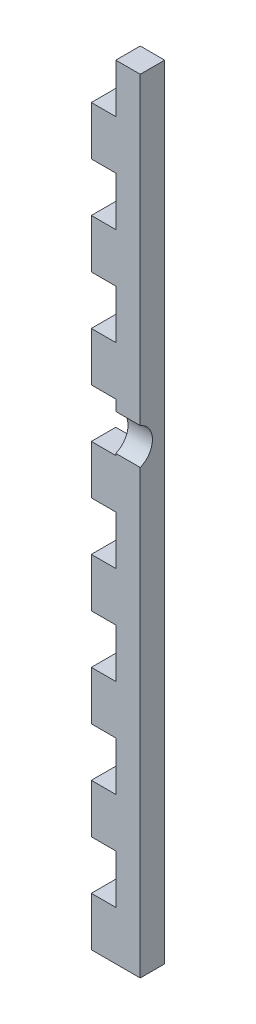
ISO-10303-21;
HEADER;
FILE_DESCRIPTION(('STEP AP214'),'2;1');
FILE_NAME('part.step','',(''),(''),'','','');
FILE_SCHEMA(('AUTOMOTIVE_DESIGN { 1 0 10303 214 1 1 1 1 }'));
ENDSEC;
DATA;
#1=APPLICATION_CONTEXT('core data for automotive mechanical design processes');
#2=APPLICATION_PROTOCOL_DEFINITION('international standard','automotive_design',2000,#1);
#3=PRODUCT_CONTEXT('',#1,'mechanical');
#4=PRODUCT('Part','Part','',(#3));
#5=PRODUCT_RELATED_PRODUCT_CATEGORY('part','',(#4));
#6=PRODUCT_DEFINITION_FORMATION('','',#4);
#7=PRODUCT_DEFINITION_CONTEXT('part definition',#1,'design');
#8=PRODUCT_DEFINITION('design','',#6,#7);
#9=PRODUCT_DEFINITION_SHAPE('','',#8);
#10=(LENGTH_UNIT() NAMED_UNIT(*) SI_UNIT(.MILLI.,.METRE.));
#11=(NAMED_UNIT(*) PLANE_ANGLE_UNIT() SI_UNIT($,.RADIAN.));
#12=(NAMED_UNIT(*) SI_UNIT($,.STERADIAN.) SOLID_ANGLE_UNIT());
#13=UNCERTAINTY_MEASURE_WITH_UNIT(LENGTH_MEASURE(1.E-05),#10,'distance_accuracy_value','');
#14=(GEOMETRIC_REPRESENTATION_CONTEXT(3) GLOBAL_UNCERTAINTY_ASSIGNED_CONTEXT((#13)) GLOBAL_UNIT_ASSIGNED_CONTEXT((#10,
#11,#12)) REPRESENTATION_CONTEXT('',''));
#15=CARTESIAN_POINT('',(0.,0.,0.));
#16=DIRECTION('',(0.,0.,1.));
#17=DIRECTION('',(1.,0.,0.));
#18=AXIS2_PLACEMENT_3D('',#15,#16,#17);
#19=CARTESIAN_POINT('',(0.,0.,5.));
#20=DIRECTION('',(0.,0.,1.));
#21=DIRECTION('',(1.,0.,0.));
#22=AXIS2_PLACEMENT_3D('',#19,#20,#21);
#23=PLANE('',#22);
#24=DIRECTION('',(-1.,0.,0.));
#25=VECTOR('',#24,1.);
#26=CARTESIAN_POINT('',(-0.50310954954895,10.909210354659,5.));
#27=LINE('',#26,#25);
#28=CARTESIAN_POINT('',(-0.50310954954895,10.909210354659,5.));
#29=VERTEX_POINT('',#28);
#30=CARTESIAN_POINT('',(-5.50310954954895,10.909210354659,5.));
#31=VERTEX_POINT('',#30);
#32=EDGE_CURVE('E11',#29,#31,#27,.T.);
#33=ORIENTED_EDGE('',*,*,#32,.F.);
#34=DIRECTION('',(0.,-1.,0.));
#35=VECTOR('',#34,1.);
#36=CARTESIAN_POINT('',(-0.50310954954957,0.,5.));
#37=LINE('',#36,#35);
#38=CARTESIAN_POINT('',(-0.503109549549579,73.1111111111111,5.));
#39=VERTEX_POINT('',#38);
#40=EDGE_CURVE('E466',#39,#29,#37,.T.);
#41=ORIENTED_EDGE('',*,*,#40,.F.);
#42=DIRECTION('',(1.,0.,0.));
#43=VECTOR('',#42,1.);
#44=CARTESIAN_POINT('',(0.,73.1111111111111,5.));
#45=LINE('',#44,#43);
#46=CARTESIAN_POINT('',(-5.50310954954958,73.1111111111111,5.));
#47=VERTEX_POINT('',#46);
#48=EDGE_CURVE('E472',#47,#39,#45,.T.);
#49=ORIENTED_EDGE('',*,*,#48,.F.);
#50=DIRECTION('',(0.,-1.,0.));
#51=VECTOR('',#50,1.);
#52=CARTESIAN_POINT('',(-5.50310954954957,0.,5.));
#53=LINE('',#52,#51);
#54=CARTESIAN_POINT('',(-5.50310954954958,63.1111111111111,5.));
#55=VERTEX_POINT('',#54);
#56=EDGE_CURVE('E477',#47,#55,#53,.T.);
#57=ORIENTED_EDGE('',*,*,#56,.T.);
#58=DIRECTION('',(1.,0.,0.));
#59=VECTOR('',#58,1.);
#60=CARTESIAN_POINT('',(0.,63.1111111111111,5.));
#61=LINE('',#60,#59);
#62=CARTESIAN_POINT('',(-10.5031095495496,63.1111111111111,5.));
#63=VERTEX_POINT('',#62);
#64=EDGE_CURVE('E479',#63,#55,#61,.T.);
#65=ORIENTED_EDGE('',*,*,#64,.F.);
#66=DIRECTION('',(0.,-1.,0.));
#67=VECTOR('',#66,1.);
#68=CARTESIAN_POINT('',(-10.5031095495496,0.,5.));
#69=LINE('',#68,#67);
#70=CARTESIAN_POINT('',(-10.5031095495494,53.1111111111111,5.));
#71=VERTEX_POINT('',#70);
#72=EDGE_CURVE('E482',#63,#71,#69,.T.);
#73=ORIENTED_EDGE('',*,*,#72,.T.);
#74=DIRECTION('',(1.,0.,0.));
#75=VECTOR('',#74,1.);
#76=CARTESIAN_POINT('',(0.,53.1111111111111,5.));
#77=LINE('',#76,#75);
#78=CARTESIAN_POINT('',(-5.50310954954937,53.1111111111111,5.));
#79=VERTEX_POINT('',#78);
#80=EDGE_CURVE('E483',#71,#79,#77,.T.);
#81=ORIENTED_EDGE('',*,*,#80,.T.);
#82=DIRECTION('',(0.,-1.,0.));
#83=VECTOR('',#82,1.);
#84=CARTESIAN_POINT('',(-5.50310954954936,0.,5.));
#85=LINE('',#84,#83);
#86=CARTESIAN_POINT('',(-5.50310954954937,43.1111111111111,5.));
#87=VERTEX_POINT('',#86);
#88=EDGE_CURVE('E485',#79,#87,#85,.T.);
#89=ORIENTED_EDGE('',*,*,#88,.T.);
#90=DIRECTION('',(1.,0.,0.));
#91=VECTOR('',#90,1.);
#92=CARTESIAN_POINT('',(0.,43.1111111111111,5.));
#93=LINE('',#92,#91);
#94=CARTESIAN_POINT('',(-10.5031095495494,43.1111111111111,5.));
#95=VERTEX_POINT('',#94);
#96=EDGE_CURVE('E487',#95,#87,#93,.T.);
#97=ORIENTED_EDGE('',*,*,#96,.F.);
#98=CARTESIAN_POINT('',(-10.5031095495496,33.1111111111111,5.));
#99=VERTEX_POINT('',#98);
#100=EDGE_CURVE('E490',#95,#99,#69,.T.);
#101=ORIENTED_EDGE('',*,*,#100,.T.);
#102=DIRECTION('',(1.,0.,0.));
#103=VECTOR('',#102,1.);
#104=CARTESIAN_POINT('',(0.,33.1111111111111,5.));
#105=LINE('',#104,#103);
#106=CARTESIAN_POINT('',(-5.50310954954916,33.1111111111111,5.));
#107=VERTEX_POINT('',#106);
#108=EDGE_CURVE('E491',#99,#107,#105,.T.);
#109=ORIENTED_EDGE('',*,*,#108,.T.);
#110=DIRECTION('',(0.,-1.,0.));
#111=VECTOR('',#110,1.);
#112=CARTESIAN_POINT('',(-5.50310954954916,0.,5.));
#113=LINE('',#112,#111);
#114=CARTESIAN_POINT('',(-5.50310954954916,23.1111111111111,5.));
#115=VERTEX_POINT('',#114);
#116=EDGE_CURVE('E493',#107,#115,#113,.T.);
#117=ORIENTED_EDGE('',*,*,#116,.T.);
#118=DIRECTION('',(1.,0.,0.));
#119=VECTOR('',#118,1.);
#120=CARTESIAN_POINT('',(0.,23.1111111111111,5.));
#121=LINE('',#120,#119);
#122=CARTESIAN_POINT('',(-10.5031095495496,23.1111111111111,5.));
#123=VERTEX_POINT('',#122);
#124=EDGE_CURVE('E495',#123,#115,#121,.T.);
#125=ORIENTED_EDGE('',*,*,#124,.F.);
#126=CARTESIAN_POINT('',(-10.5031095495496,13.1111111111111,5.));
#127=VERTEX_POINT('',#126);
#128=EDGE_CURVE('E498',#123,#127,#69,.T.);
#129=ORIENTED_EDGE('',*,*,#128,.T.);
#130=DIRECTION('',(1.,0.,0.));
#131=VECTOR('',#130,1.);
#132=CARTESIAN_POINT('',(0.,13.1111111111111,5.));
#133=LINE('',#132,#131);
#134=CARTESIAN_POINT('',(-5.50310954954895,13.1111111111111,5.));
#135=VERTEX_POINT('',#134);
#136=EDGE_CURVE('E499',#127,#135,#133,.T.);
#137=ORIENTED_EDGE('',*,*,#136,.T.);
#138=DIRECTION('',(0.,-1.,0.));
#139=VECTOR('',#138,1.);
#140=CARTESIAN_POINT('',(-5.50310954954895,0.,5.));
#141=LINE('',#140,#139);
#142=EDGE_CURVE('E502',#135,#31,#141,.T.);
#143=ORIENTED_EDGE('',*,*,#142,.T.);
#144=EDGE_LOOP('',(#33,#41,#49,#57,#65,#73,#81,#89,#97,#101,#109,#117,#125,#129,#137,#143));
#145=FACE_BOUND('',#144,.T.);
#146=ADVANCED_FACE('F35',(#145),#23,.T.);
#147=CARTESIAN_POINT('',(0.,-76.8888888888889,5.));
#148=DIRECTION('',(0.,1.,0.));
#149=DIRECTION('',(0.,0.,1.));
#150=AXIS2_PLACEMENT_3D('',#147,#148,#149);
#151=PLANE('',#150);
#152=DIRECTION('',(1.,0.,0.));
#153=VECTOR('',#152,1.);
#154=CARTESIAN_POINT('',(0.,-76.8888888888889,0.));
#155=LINE('',#154,#153);
#156=CARTESIAN_POINT('',(-10.5031095495496,-76.8888888888889,0.));
#157=VERTEX_POINT('',#156);
#158=CARTESIAN_POINT('',(-5.50310954954811,-76.8888888888889,0.));
#159=VERTEX_POINT('',#158);
#160=EDGE_CURVE('E299',#157,#159,#155,.T.);
#161=ORIENTED_EDGE('',*,*,#160,.F.);
#162=DIRECTION('',(0.,0.,-1.));
#163=VECTOR('',#162,1.);
#164=CARTESIAN_POINT('',(-10.5031095495496,-76.8888888888889,5.));
#165=LINE('',#164,#163);
#166=CARTESIAN_POINT('',(-10.5031095495496,-76.8888888888889,5.));
#167=VERTEX_POINT('',#166);
#168=EDGE_CURVE('E174',#167,#157,#165,.T.);
#169=ORIENTED_EDGE('',*,*,#168,.F.);
#170=DIRECTION('',(1.,0.,0.));
#171=VECTOR('',#170,1.);
#172=CARTESIAN_POINT('',(0.,-76.8888888888889,5.));
#173=LINE('',#172,#171);
#174=CARTESIAN_POINT('',(-5.50310954954811,-76.8888888888889,5.));
#175=VERTEX_POINT('',#174);
#176=EDGE_CURVE('E378',#167,#175,#173,.T.);
#177=ORIENTED_EDGE('',*,*,#176,.T.);
#178=DIRECTION('',(0.,0.,-1.));
#179=VECTOR('',#178,1.);
#180=CARTESIAN_POINT('',(-5.50310954954811,-76.8888888888889,5.));
#181=LINE('',#180,#179);
#182=EDGE_CURVE('E169',#175,#159,#181,.T.);
#183=ORIENTED_EDGE('',*,*,#182,.T.);
#184=EDGE_LOOP('',(#161,#169,#177,#183));
#185=FACE_BOUND('',#184,.T.);
#186=ADVANCED_FACE('F37',(#185),#151,.T.);
#187=CARTESIAN_POINT('',(-10.5031095495496,0.,5.));
#188=DIRECTION('',(1.,0.,0.));
#189=DIRECTION('',(0.,1.,0.));
#190=AXIS2_PLACEMENT_3D('',#187,#188,#189);
#191=PLANE('',#190);
#192=DIRECTION('',(0.,-1.,0.));
#193=VECTOR('',#192,1.);
#194=CARTESIAN_POINT('',(-10.5031095495496,0.,0.));
#195=LINE('',#194,#193);
#196=CARTESIAN_POINT('',(-10.5031095495496,-86.8888888888889,0.));
#197=VERTEX_POINT('',#196);
#198=EDGE_CURVE('E302',#157,#197,#195,.T.);
#199=ORIENTED_EDGE('',*,*,#198,.T.);
#200=DIRECTION('',(0.,0.,-1.));
#201=VECTOR('',#200,1.);
#202=CARTESIAN_POINT('',(-10.5031095495496,-86.8888888888889,5.));
#203=LINE('',#202,#201);
#204=CARTESIAN_POINT('',(-10.5031095495496,-86.8888888888889,5.));
#205=VERTEX_POINT('',#204);
#206=EDGE_CURVE('E450',#205,#197,#203,.T.);
#207=ORIENTED_EDGE('',*,*,#206,.F.);
#208=EDGE_CURVE('E281',#167,#205,#69,.T.);
#209=ORIENTED_EDGE('',*,*,#208,.F.);
#210=ORIENTED_EDGE('',*,*,#168,.T.);
#211=EDGE_LOOP('',(#199,#207,#209,#210));
#212=FACE_BOUND('',#211,.T.);
#213=ADVANCED_FACE('F660',(#212),#191,.F.);
#214=CARTESIAN_POINT('',(0.,-86.8888888888889,5.));
#215=DIRECTION('',(0.,1.,0.));
#216=DIRECTION('',(0.,0.,1.));
#217=AXIS2_PLACEMENT_3D('',#214,#215,#216);
#218=PLANE('',#217);
#219=DIRECTION('',(1.,0.,0.));
#220=VECTOR('',#219,1.);
#221=CARTESIAN_POINT('',(0.,-86.8888888888889,0.));
#222=LINE('',#221,#220);
#223=CARTESIAN_POINT('',(-0.50310954954956,-86.8888888888889,0.));
#224=VERTEX_POINT('',#223);
#225=EDGE_CURVE('E305',#197,#224,#222,.T.);
#226=ORIENTED_EDGE('',*,*,#225,.T.);
#227=DIRECTION('',(0.,0.,-1.));
#228=VECTOR('',#227,1.);
#229=CARTESIAN_POINT('',(-0.50310954954956,-86.8888888888889,5.));
#230=LINE('',#229,#228);
#231=CARTESIAN_POINT('',(-0.50310954954956,-86.8888888888889,5.));
#232=VERTEX_POINT('',#231);
#233=EDGE_CURVE('E448',#232,#224,#230,.T.);
#234=ORIENTED_EDGE('',*,*,#233,.F.);
#235=DIRECTION('',(1.,0.,0.));
#236=VECTOR('',#235,1.);
#237=CARTESIAN_POINT('',(0.,-86.8888888888889,5.));
#238=LINE('',#237,#236);
#239=EDGE_CURVE('E469',#205,#232,#238,.T.);
#240=ORIENTED_EDGE('',*,*,#239,.F.);
#241=ORIENTED_EDGE('',*,*,#206,.T.);
#242=EDGE_LOOP('',(#226,#234,#240,#241));
#243=FACE_BOUND('',#242,.T.);
#244=ADVANCED_FACE('F819',(#243),#218,.F.);
#245=CARTESIAN_POINT('',(-0.50310954954957,0.,5.));
#246=DIRECTION('',(1.,0.,0.));
#247=DIRECTION('',(0.,1.,0.));
#248=AXIS2_PLACEMENT_3D('',#245,#246,#247);
#249=PLANE('',#248);
#250=CARTESIAN_POINT('',(-0.50310954954895,7.20111111111112,6.5));
#251=DIRECTION('',(-1.,0.,0.));
#252=DIRECTION('',(0.,-1.,0.));
#253=AXIS2_PLACEMENT_3D('',#250,#251,#252);
#254=CIRCLE('',#253,4.);
#255=CARTESIAN_POINT('',(-0.503109549548949,3.49301186756329,5.));
#256=VERTEX_POINT('',#255);
#257=EDGE_CURVE('E303',#29,#256,#254,.T.);
#258=ORIENTED_EDGE('',*,*,#257,.T.);
#259=EDGE_CURVE('E463',#256,#232,#37,.T.);
#260=ORIENTED_EDGE('',*,*,#259,.T.);
#261=ORIENTED_EDGE('',*,*,#233,.T.);
#262=DIRECTION('',(0.,-1.,0.));
#263=VECTOR('',#262,1.);
#264=CARTESIAN_POINT('',(-0.50310954954957,0.,0.));
#265=LINE('',#264,#263);
#266=CARTESIAN_POINT('',(-0.503109549549579,73.1111111111111,0.));
#267=VERTEX_POINT('',#266);
#268=EDGE_CURVE('E309',#267,#224,#265,.T.);
#269=ORIENTED_EDGE('',*,*,#268,.F.);
#270=DIRECTION('',(0.,0.,-1.));
#271=VECTOR('',#270,1.);
#272=CARTESIAN_POINT('',(-0.503109549549579,73.1111111111111,5.));
#273=LINE('',#272,#271);
#274=EDGE_CURVE('E446',#39,#267,#273,.T.);
#275=ORIENTED_EDGE('',*,*,#274,.F.);
#276=ORIENTED_EDGE('',*,*,#40,.T.);
#277=EDGE_LOOP('',(#258,#260,#261,#269,#275,#276));
#278=FACE_BOUND('',#277,.T.);
#279=ADVANCED_FACE('F462',(#278),#249,.T.);
#280=CARTESIAN_POINT('',(0.,73.1111111111111,5.));
#281=DIRECTION('',(0.,1.,0.));
#282=DIRECTION('',(0.,0.,1.));
#283=AXIS2_PLACEMENT_3D('',#280,#281,#282);
#284=PLANE('',#283);
#285=DIRECTION('',(1.,0.,0.));
#286=VECTOR('',#285,1.);
#287=CARTESIAN_POINT('',(0.,73.1111111111111,0.));
#288=LINE('',#287,#286);
#289=CARTESIAN_POINT('',(-5.50310954954958,73.1111111111111,0.));
#290=VERTEX_POINT('',#289);
#291=EDGE_CURVE('E312',#290,#267,#288,.T.);
#292=ORIENTED_EDGE('',*,*,#291,.F.);
#293=DIRECTION('',(0.,0.,-1.));
#294=VECTOR('',#293,1.);
#295=CARTESIAN_POINT('',(-5.50310954954958,73.1111111111111,5.));
#296=LINE('',#295,#294);
#297=EDGE_CURVE('E444',#47,#290,#296,.T.);
#298=ORIENTED_EDGE('',*,*,#297,.F.);
#299=ORIENTED_EDGE('',*,*,#48,.T.);
#300=ORIENTED_EDGE('',*,*,#274,.T.);
#301=EDGE_LOOP('',(#292,#298,#299,#300));
#302=FACE_BOUND('',#301,.T.);
#303=ADVANCED_FACE('F818',(#302),#284,.T.);
#304=CARTESIAN_POINT('',(-5.50310954954957,0.,5.));
#305=DIRECTION('',(1.,0.,0.));
#306=DIRECTION('',(0.,1.,0.));
#307=AXIS2_PLACEMENT_3D('',#304,#305,#306);
#308=PLANE('',#307);
#309=DIRECTION('',(0.,-1.,0.));
#310=VECTOR('',#309,1.);
#311=CARTESIAN_POINT('',(-5.50310954954957,0.,0.));
#312=LINE('',#311,#310);
#313=CARTESIAN_POINT('',(-5.50310954954958,63.1111111111111,0.));
#314=VERTEX_POINT('',#313);
#315=EDGE_CURVE('E315',#290,#314,#312,.T.);
#316=ORIENTED_EDGE('',*,*,#315,.T.);
#317=DIRECTION('',(0.,0.,-1.));
#318=VECTOR('',#317,1.);
#319=CARTESIAN_POINT('',(-5.50310954954958,63.1111111111111,5.));
#320=LINE('',#319,#318);
#321=EDGE_CURVE('E442',#55,#314,#320,.T.);
#322=ORIENTED_EDGE('',*,*,#321,.F.);
#323=ORIENTED_EDGE('',*,*,#56,.F.);
#324=ORIENTED_EDGE('',*,*,#297,.T.);
#325=EDGE_LOOP('',(#316,#322,#323,#324));
#326=FACE_BOUND('',#325,.T.);
#327=ADVANCED_FACE('F834',(#326),#308,.F.);
#328=CARTESIAN_POINT('',(0.,63.1111111111111,5.));
#329=DIRECTION('',(0.,1.,0.));
#330=DIRECTION('',(0.,0.,1.));
#331=AXIS2_PLACEMENT_3D('',#328,#329,#330);
#332=PLANE('',#331);
#333=DIRECTION('',(1.,0.,0.));
#334=VECTOR('',#333,1.);
#335=CARTESIAN_POINT('',(0.,63.1111111111111,0.));
#336=LINE('',#335,#334);
#337=CARTESIAN_POINT('',(-10.5031095495496,63.1111111111111,0.));
#338=VERTEX_POINT('',#337);
#339=EDGE_CURVE('E318',#338,#314,#336,.T.);
#340=ORIENTED_EDGE('',*,*,#339,.F.);
#341=DIRECTION('',(0.,0.,-1.));
#342=VECTOR('',#341,1.);
#343=CARTESIAN_POINT('',(-10.5031095495496,63.1111111111111,5.));
#344=LINE('',#343,#342);
#345=EDGE_CURVE('E440',#63,#338,#344,.T.);
#346=ORIENTED_EDGE('',*,*,#345,.F.);
#347=ORIENTED_EDGE('',*,*,#64,.T.);
#348=ORIENTED_EDGE('',*,*,#321,.T.);
#349=EDGE_LOOP('',(#340,#346,#347,#348));
#350=FACE_BOUND('',#349,.T.);
#351=ADVANCED_FACE('F841',(#350),#332,.T.);
#352=CARTESIAN_POINT('',(-10.5031095495494,53.1111111111111,0.));
#353=VERTEX_POINT('',#352);
#354=EDGE_CURVE('E306',#338,#353,#195,.T.);
#355=ORIENTED_EDGE('',*,*,#354,.T.);
#356=DIRECTION('',(0.,0.,-1.));
#357=VECTOR('',#356,1.);
#358=CARTESIAN_POINT('',(-10.5031095495494,53.1111111111111,5.));
#359=LINE('',#358,#357);
#360=EDGE_CURVE('E437',#71,#353,#359,.T.);
#361=ORIENTED_EDGE('',*,*,#360,.F.);
#362=ORIENTED_EDGE('',*,*,#72,.F.);
#363=ORIENTED_EDGE('',*,*,#345,.T.);
#364=EDGE_LOOP('',(#355,#361,#362,#363));
#365=FACE_BOUND('',#364,.T.);
#366=ADVANCED_FACE('F553',(#365),#191,.F.);
#367=CARTESIAN_POINT('',(0.,53.1111111111111,5.));
#368=DIRECTION('',(0.,1.,0.));
#369=DIRECTION('',(0.,0.,1.));
#370=AXIS2_PLACEMENT_3D('',#367,#368,#369);
#371=PLANE('',#370);
#372=DIRECTION('',(1.,0.,0.));
#373=VECTOR('',#372,1.);
#374=CARTESIAN_POINT('',(0.,53.1111111111111,0.));
#375=LINE('',#374,#373);
#376=CARTESIAN_POINT('',(-5.50310954954937,53.1111111111111,0.));
#377=VERTEX_POINT('',#376);
#378=EDGE_CURVE('E321',#353,#377,#375,.T.);
#379=ORIENTED_EDGE('',*,*,#378,.T.);
#380=DIRECTION('',(0.,0.,-1.));
#381=VECTOR('',#380,1.);
#382=CARTESIAN_POINT('',(-5.50310954954937,53.1111111111111,5.));
#383=LINE('',#382,#381);
#384=EDGE_CURVE('E434',#79,#377,#383,.T.);
#385=ORIENTED_EDGE('',*,*,#384,.F.);
#386=ORIENTED_EDGE('',*,*,#80,.F.);
#387=ORIENTED_EDGE('',*,*,#360,.T.);
#388=EDGE_LOOP('',(#379,#385,#386,#387));
#389=FACE_BOUND('',#388,.T.);
#390=ADVANCED_FACE('F559',(#389),#371,.F.);
#391=CARTESIAN_POINT('',(-5.50310954954936,0.,5.));
#392=DIRECTION('',(1.,0.,0.));
#393=DIRECTION('',(0.,1.,0.));
#394=AXIS2_PLACEMENT_3D('',#391,#392,#393);
#395=PLANE('',#394);
#396=DIRECTION('',(0.,-1.,0.));
#397=VECTOR('',#396,1.);
#398=CARTESIAN_POINT('',(-5.50310954954936,0.,0.));
#399=LINE('',#398,#397);
#400=CARTESIAN_POINT('',(-5.50310954954937,43.1111111111111,0.));
#401=VERTEX_POINT('',#400);
#402=EDGE_CURVE('E323',#377,#401,#399,.T.);
#403=ORIENTED_EDGE('',*,*,#402,.T.);
#404=DIRECTION('',(0.,0.,-1.));
#405=VECTOR('',#404,1.);
#406=CARTESIAN_POINT('',(-5.50310954954937,43.1111111111111,5.));
#407=LINE('',#406,#405);
#408=EDGE_CURVE('E432',#87,#401,#407,.T.);
#409=ORIENTED_EDGE('',*,*,#408,.F.);
#410=ORIENTED_EDGE('',*,*,#88,.F.);
#411=ORIENTED_EDGE('',*,*,#384,.T.);
#412=EDGE_LOOP('',(#403,#409,#410,#411));
#413=FACE_BOUND('',#412,.T.);
#414=ADVANCED_FACE('F565',(#413),#395,.F.);
#415=CARTESIAN_POINT('',(0.,43.1111111111111,5.));
#416=DIRECTION('',(0.,1.,0.));
#417=DIRECTION('',(0.,0.,1.));
#418=AXIS2_PLACEMENT_3D('',#415,#416,#417);
#419=PLANE('',#418);
#420=DIRECTION('',(1.,0.,0.));
#421=VECTOR('',#420,1.);
#422=CARTESIAN_POINT('',(0.,43.1111111111111,0.));
#423=LINE('',#422,#421);
#424=CARTESIAN_POINT('',(-10.5031095495494,43.1111111111111,0.));
#425=VERTEX_POINT('',#424);
#426=EDGE_CURVE('E326',#425,#401,#423,.T.);
#427=ORIENTED_EDGE('',*,*,#426,.F.);
#428=DIRECTION('',(0.,0.,-1.));
#429=VECTOR('',#428,1.);
#430=CARTESIAN_POINT('',(-10.5031095495494,43.1111111111111,5.));
#431=LINE('',#430,#429);
#432=EDGE_CURVE('E430',#95,#425,#431,.T.);
#433=ORIENTED_EDGE('',*,*,#432,.F.);
#434=ORIENTED_EDGE('',*,*,#96,.T.);
#435=ORIENTED_EDGE('',*,*,#408,.T.);
#436=EDGE_LOOP('',(#427,#433,#434,#435));
#437=FACE_BOUND('',#436,.T.);
#438=ADVANCED_FACE('F645',(#437),#419,.T.);
#439=CARTESIAN_POINT('',(-10.5031095495496,33.1111111111111,0.));
#440=VERTEX_POINT('',#439);
#441=EDGE_CURVE('E329',#425,#440,#195,.T.);
#442=ORIENTED_EDGE('',*,*,#441,.T.);
#443=DIRECTION('',(0.,0.,-1.));
#444=VECTOR('',#443,1.);
#445=CARTESIAN_POINT('',(-10.5031095495496,33.1111111111111,5.));
#446=LINE('',#445,#444);
#447=EDGE_CURVE('E427',#99,#440,#446,.T.);
#448=ORIENTED_EDGE('',*,*,#447,.F.);
#449=ORIENTED_EDGE('',*,*,#100,.F.);
#450=ORIENTED_EDGE('',*,*,#432,.T.);
#451=EDGE_LOOP('',(#442,#448,#449,#450));
#452=FACE_BOUND('',#451,.T.);
#453=ADVANCED_FACE('F643',(#452),#191,.F.);
#454=CARTESIAN_POINT('',(0.,33.1111111111111,5.));
#455=DIRECTION('',(0.,1.,0.));
#456=DIRECTION('',(0.,0.,1.));
#457=AXIS2_PLACEMENT_3D('',#454,#455,#456);
#458=PLANE('',#457);
#459=DIRECTION('',(1.,0.,0.));
#460=VECTOR('',#459,1.);
#461=CARTESIAN_POINT('',(0.,33.1111111111111,0.));
#462=LINE('',#461,#460);
#463=CARTESIAN_POINT('',(-5.50310954954916,33.1111111111111,0.));
#464=VERTEX_POINT('',#463);
#465=EDGE_CURVE('E330',#440,#464,#462,.T.);
#466=ORIENTED_EDGE('',*,*,#465,.T.);
#467=DIRECTION('',(0.,0.,-1.));
#468=VECTOR('',#467,1.);
#469=CARTESIAN_POINT('',(-5.50310954954916,33.1111111111111,5.));
#470=LINE('',#469,#468);
#471=EDGE_CURVE('E424',#107,#464,#470,.T.);
#472=ORIENTED_EDGE('',*,*,#471,.F.);
#473=ORIENTED_EDGE('',*,*,#108,.F.);
#474=ORIENTED_EDGE('',*,*,#447,.T.);
#475=EDGE_LOOP('',(#466,#472,#473,#474));
#476=FACE_BOUND('',#475,.T.);
#477=ADVANCED_FACE('F642',(#476),#458,.F.);
#478=CARTESIAN_POINT('',(-5.50310954954916,0.,5.));
#479=DIRECTION('',(1.,0.,0.));
#480=DIRECTION('',(0.,1.,0.));
#481=AXIS2_PLACEMENT_3D('',#478,#479,#480);
#482=PLANE('',#481);
#483=DIRECTION('',(0.,-1.,0.));
#484=VECTOR('',#483,1.);
#485=CARTESIAN_POINT('',(-5.50310954954916,0.,0.));
#486=LINE('',#485,#484);
#487=CARTESIAN_POINT('',(-5.50310954954916,23.1111111111111,0.));
#488=VERTEX_POINT('',#487);
#489=EDGE_CURVE('E332',#464,#488,#486,.T.);
#490=ORIENTED_EDGE('',*,*,#489,.T.);
#491=DIRECTION('',(0.,0.,-1.));
#492=VECTOR('',#491,1.);
#493=CARTESIAN_POINT('',(-5.50310954954916,23.1111111111111,5.));
#494=LINE('',#493,#492);
#495=EDGE_CURVE('E422',#115,#488,#494,.T.);
#496=ORIENTED_EDGE('',*,*,#495,.F.);
#497=ORIENTED_EDGE('',*,*,#116,.F.);
#498=ORIENTED_EDGE('',*,*,#471,.T.);
#499=EDGE_LOOP('',(#490,#496,#497,#498));
#500=FACE_BOUND('',#499,.T.);
#501=ADVANCED_FACE('F638',(#500),#482,.F.);
#502=CARTESIAN_POINT('',(0.,23.1111111111111,5.));
#503=DIRECTION('',(0.,1.,0.));
#504=DIRECTION('',(0.,0.,1.));
#505=AXIS2_PLACEMENT_3D('',#502,#503,#504);
#506=PLANE('',#505);
#507=DIRECTION('',(1.,0.,0.));
#508=VECTOR('',#507,1.);
#509=CARTESIAN_POINT('',(0.,23.1111111111111,0.));
#510=LINE('',#509,#508);
#511=CARTESIAN_POINT('',(-10.5031095495496,23.1111111111111,0.));
#512=VERTEX_POINT('',#511);
#513=EDGE_CURVE('E335',#512,#488,#510,.T.);
#514=ORIENTED_EDGE('',*,*,#513,.F.);
#515=DIRECTION('',(0.,0.,-1.));
#516=VECTOR('',#515,1.);
#517=CARTESIAN_POINT('',(-10.5031095495496,23.1111111111111,5.));
#518=LINE('',#517,#516);
#519=EDGE_CURVE('E420',#123,#512,#518,.T.);
#520=ORIENTED_EDGE('',*,*,#519,.F.);
#521=ORIENTED_EDGE('',*,*,#124,.T.);
#522=ORIENTED_EDGE('',*,*,#495,.T.);
#523=EDGE_LOOP('',(#514,#520,#521,#522));
#524=FACE_BOUND('',#523,.T.);
#525=ADVANCED_FACE('F634',(#524),#506,.T.);
#526=CARTESIAN_POINT('',(-10.5031095495496,13.1111111111111,0.));
#527=VERTEX_POINT('',#526);
#528=EDGE_CURVE('E338',#512,#527,#195,.T.);
#529=ORIENTED_EDGE('',*,*,#528,.T.);
#530=DIRECTION('',(0.,0.,-1.));
#531=VECTOR('',#530,1.);
#532=CARTESIAN_POINT('',(-10.5031095495496,13.1111111111111,5.));
#533=LINE('',#532,#531);
#534=EDGE_CURVE('E417',#127,#527,#533,.T.);
#535=ORIENTED_EDGE('',*,*,#534,.F.);
#536=ORIENTED_EDGE('',*,*,#128,.F.);
#537=ORIENTED_EDGE('',*,*,#519,.T.);
#538=EDGE_LOOP('',(#529,#535,#536,#537));
#539=FACE_BOUND('',#538,.T.);
#540=ADVANCED_FACE('F629',(#539),#191,.F.);
#541=CARTESIAN_POINT('',(0.,13.1111111111111,5.));
#542=DIRECTION('',(0.,1.,0.));
#543=DIRECTION('',(0.,0.,1.));
#544=AXIS2_PLACEMENT_3D('',#541,#542,#543);
#545=PLANE('',#544);
#546=DIRECTION('',(1.,0.,0.));
#547=VECTOR('',#546,1.);
#548=CARTESIAN_POINT('',(0.,13.1111111111111,0.));
#549=LINE('',#548,#547);
#550=CARTESIAN_POINT('',(-5.50310954954895,13.1111111111111,0.));
#551=VERTEX_POINT('',#550);
#552=EDGE_CURVE('E339',#527,#551,#549,.T.);
#553=ORIENTED_EDGE('',*,*,#552,.T.);
#554=DIRECTION('',(0.,0.,-1.));
#555=VECTOR('',#554,1.);
#556=CARTESIAN_POINT('',(-5.50310954954895,13.1111111111111,5.));
#557=LINE('',#556,#555);
#558=EDGE_CURVE('E414',#135,#551,#557,.T.);
#559=ORIENTED_EDGE('',*,*,#558,.F.);
#560=ORIENTED_EDGE('',*,*,#136,.F.);
#561=ORIENTED_EDGE('',*,*,#534,.T.);
#562=EDGE_LOOP('',(#553,#559,#560,#561));
#563=FACE_BOUND('',#562,.T.);
#564=ADVANCED_FACE('F628',(#563),#545,.F.);
#565=CARTESIAN_POINT('',(-5.50310954954895,0.,5.));
#566=DIRECTION('',(1.,0.,0.));
#567=DIRECTION('',(0.,1.,0.));
#568=AXIS2_PLACEMENT_3D('',#565,#566,#567);
#569=PLANE('',#568);
#570=CARTESIAN_POINT('',(-5.50310954954895,3.49301186756329,5.));
#571=VERTEX_POINT('',#570);
#572=CARTESIAN_POINT('',(-5.50310954954895,3.11111111111112,5.));
#573=VERTEX_POINT('',#572);
#574=EDGE_CURVE('E501',#571,#573,#141,.T.);
#575=ORIENTED_EDGE('',*,*,#574,.F.);
#576=CARTESIAN_POINT('',(-5.50310954954895,7.20111111111112,6.5));
#577=DIRECTION('',(-1.,0.,0.));
#578=DIRECTION('',(0.,-1.,0.));
#579=AXIS2_PLACEMENT_3D('',#576,#577,#578);
#580=CIRCLE('',#579,4.);
#581=EDGE_CURVE('E49',#31,#571,#580,.T.);
#582=ORIENTED_EDGE('',*,*,#581,.F.);
#583=ORIENTED_EDGE('',*,*,#142,.F.);
#584=ORIENTED_EDGE('',*,*,#558,.T.);
#585=DIRECTION('',(0.,-1.,0.));
#586=VECTOR('',#585,1.);
#587=CARTESIAN_POINT('',(-5.50310954954895,0.,0.));
#588=LINE('',#587,#586);
#589=CARTESIAN_POINT('',(-5.50310954954895,3.11111111111112,0.));
#590=VERTEX_POINT('',#589);
#591=EDGE_CURVE('E341',#551,#590,#588,.T.);
#592=ORIENTED_EDGE('',*,*,#591,.T.);
#593=DIRECTION('',(0.,0.,-1.));
#594=VECTOR('',#593,1.);
#595=CARTESIAN_POINT('',(-5.50310954954895,3.11111111111112,5.));
#596=LINE('',#595,#594);
#597=EDGE_CURVE('E412',#573,#590,#596,.T.);
#598=ORIENTED_EDGE('',*,*,#597,.F.);
#599=EDGE_LOOP('',(#575,#582,#583,#584,#592,#598));
#600=FACE_BOUND('',#599,.T.);
#601=ADVANCED_FACE('F623',(#600),#569,.F.);
#602=CARTESIAN_POINT('',(0.,3.11111111111112,5.));
#603=DIRECTION('',(0.,1.,0.));
#604=DIRECTION('',(0.,0.,1.));
#605=AXIS2_PLACEMENT_3D('',#602,#603,#604);
#606=PLANE('',#605);
#607=DIRECTION('',(1.,0.,0.));
#608=VECTOR('',#607,1.);
#609=CARTESIAN_POINT('',(0.,3.11111111111112,0.));
#610=LINE('',#609,#608);
#611=CARTESIAN_POINT('',(-10.5031095495496,3.11111111111112,0.));
#612=VERTEX_POINT('',#611);
#613=EDGE_CURVE('E344',#612,#590,#610,.T.);
#614=ORIENTED_EDGE('',*,*,#613,.F.);
#615=DIRECTION('',(0.,0.,-1.));
#616=VECTOR('',#615,1.);
#617=CARTESIAN_POINT('',(-10.5031095495496,3.11111111111112,5.));
#618=LINE('',#617,#616);
#619=CARTESIAN_POINT('',(-10.5031095495496,3.11111111111112,5.));
#620=VERTEX_POINT('',#619);
#621=EDGE_CURVE('E410',#620,#612,#618,.T.);
#622=ORIENTED_EDGE('',*,*,#621,.F.);
#623=DIRECTION('',(1.,0.,0.));
#624=VECTOR('',#623,1.);
#625=CARTESIAN_POINT('',(0.,3.11111111111112,5.));
#626=LINE('',#625,#624);
#627=EDGE_CURVE('E505',#620,#573,#626,.T.);
#628=ORIENTED_EDGE('',*,*,#627,.T.);
#629=ORIENTED_EDGE('',*,*,#597,.T.);
#630=EDGE_LOOP('',(#614,#622,#628,#629));
#631=FACE_BOUND('',#630,.T.);
#632=ADVANCED_FACE('F619',(#631),#606,.T.);
#633=CARTESIAN_POINT('',(-10.5031095495496,-6.88888888888889,0.));
#634=VERTEX_POINT('',#633);
#635=EDGE_CURVE('E347',#612,#634,#195,.T.);
#636=ORIENTED_EDGE('',*,*,#635,.T.);
#637=DIRECTION('',(0.,0.,-1.));
#638=VECTOR('',#637,1.);
#639=CARTESIAN_POINT('',(-10.5031095495496,-6.88888888888889,5.));
#640=LINE('',#639,#638);
#641=CARTESIAN_POINT('',(-10.5031095495496,-6.88888888888889,5.));
#642=VERTEX_POINT('',#641);
#643=EDGE_CURVE('E407',#642,#634,#640,.T.);
#644=ORIENTED_EDGE('',*,*,#643,.F.);
#645=EDGE_CURVE('E508',#620,#642,#69,.T.);
#646=ORIENTED_EDGE('',*,*,#645,.F.);
#647=ORIENTED_EDGE('',*,*,#621,.T.);
#648=EDGE_LOOP('',(#636,#644,#646,#647));
#649=FACE_BOUND('',#648,.T.);
#650=ADVANCED_FACE('F615',(#649),#191,.F.);
#651=CARTESIAN_POINT('',(0.,-6.88888888888889,5.));
#652=DIRECTION('',(0.,1.,0.));
#653=DIRECTION('',(0.,0.,1.));
#654=AXIS2_PLACEMENT_3D('',#651,#652,#653);
#655=PLANE('',#654);
#656=DIRECTION('',(1.,0.,0.));
#657=VECTOR('',#656,1.);
#658=CARTESIAN_POINT('',(0.,-6.88888888888889,0.));
#659=LINE('',#658,#657);
#660=CARTESIAN_POINT('',(-5.50310954954874,-6.88888888888889,0.));
#661=VERTEX_POINT('',#660);
#662=EDGE_CURVE('E348',#634,#661,#659,.T.);
#663=ORIENTED_EDGE('',*,*,#662,.T.);
#664=DIRECTION('',(0.,0.,-1.));
#665=VECTOR('',#664,1.);
#666=CARTESIAN_POINT('',(-5.50310954954874,-6.88888888888889,5.));
#667=LINE('',#666,#665);
#668=CARTESIAN_POINT('',(-5.50310954954874,-6.88888888888889,5.));
#669=VERTEX_POINT('',#668);
#670=EDGE_CURVE('E404',#669,#661,#667,.T.);
#671=ORIENTED_EDGE('',*,*,#670,.F.);
#672=DIRECTION('',(1.,0.,0.));
#673=VECTOR('',#672,1.);
#674=CARTESIAN_POINT('',(0.,-6.88888888888889,5.));
#675=LINE('',#674,#673);
#676=EDGE_CURVE('E509',#642,#669,#675,.T.);
#677=ORIENTED_EDGE('',*,*,#676,.F.);
#678=ORIENTED_EDGE('',*,*,#643,.T.);
#679=EDGE_LOOP('',(#663,#671,#677,#678));
#680=FACE_BOUND('',#679,.T.);
#681=ADVANCED_FACE('F614',(#680),#655,.F.);
#682=CARTESIAN_POINT('',(-5.50310954954874,0.,5.));
#683=DIRECTION('',(1.,0.,0.));
#684=DIRECTION('',(0.,1.,0.));
#685=AXIS2_PLACEMENT_3D('',#682,#683,#684);
#686=PLANE('',#685);
#687=DIRECTION('',(0.,-1.,0.));
#688=VECTOR('',#687,1.);
#689=CARTESIAN_POINT('',(-5.50310954954874,0.,0.));
#690=LINE('',#689,#688);
#691=CARTESIAN_POINT('',(-5.50310954954874,-16.8888888888889,0.));
#692=VERTEX_POINT('',#691);
#693=EDGE_CURVE('E350',#661,#692,#690,.T.);
#694=ORIENTED_EDGE('',*,*,#693,.T.);
#695=DIRECTION('',(0.,0.,-1.));
#696=VECTOR('',#695,1.);
#697=CARTESIAN_POINT('',(-5.50310954954874,-16.8888888888889,5.));
#698=LINE('',#697,#696);
#699=CARTESIAN_POINT('',(-5.50310954954874,-16.8888888888889,5.));
#700=VERTEX_POINT('',#699);
#701=EDGE_CURVE('E402',#700,#692,#698,.T.);
#702=ORIENTED_EDGE('',*,*,#701,.F.);
#703=DIRECTION('',(0.,-1.,0.));
#704=VECTOR('',#703,1.);
#705=CARTESIAN_POINT('',(-5.50310954954874,0.,5.));
#706=LINE('',#705,#704);
#707=EDGE_CURVE('E511',#669,#700,#706,.T.);
#708=ORIENTED_EDGE('',*,*,#707,.F.);
#709=ORIENTED_EDGE('',*,*,#670,.T.);
#710=EDGE_LOOP('',(#694,#702,#708,#709));
#711=FACE_BOUND('',#710,.T.);
#712=ADVANCED_FACE('F610',(#711),#686,.F.);
#713=CARTESIAN_POINT('',(0.,-16.8888888888889,5.));
#714=DIRECTION('',(0.,1.,0.));
#715=DIRECTION('',(0.,0.,1.));
#716=AXIS2_PLACEMENT_3D('',#713,#714,#715);
#717=PLANE('',#716);
#718=DIRECTION('',(1.,0.,0.));
#719=VECTOR('',#718,1.);
#720=CARTESIAN_POINT('',(0.,-16.8888888888889,0.));
#721=LINE('',#720,#719);
#722=CARTESIAN_POINT('',(-10.5031095495496,-16.8888888888889,0.));
#723=VERTEX_POINT('',#722);
#724=EDGE_CURVE('E353',#723,#692,#721,.T.);
#725=ORIENTED_EDGE('',*,*,#724,.F.);
#726=DIRECTION('',(0.,0.,-1.));
#727=VECTOR('',#726,1.);
#728=CARTESIAN_POINT('',(-10.5031095495496,-16.8888888888889,5.));
#729=LINE('',#728,#727);
#730=CARTESIAN_POINT('',(-10.5031095495496,-16.8888888888889,5.));
#731=VERTEX_POINT('',#730);
#732=EDGE_CURVE('E400',#731,#723,#729,.T.);
#733=ORIENTED_EDGE('',*,*,#732,.F.);
#734=DIRECTION('',(1.,0.,0.));
#735=VECTOR('',#734,1.);
#736=CARTESIAN_POINT('',(0.,-16.8888888888889,5.));
#737=LINE('',#736,#735);
#738=EDGE_CURVE('E513',#731,#700,#737,.T.);
#739=ORIENTED_EDGE('',*,*,#738,.T.);
#740=ORIENTED_EDGE('',*,*,#701,.T.);
#741=EDGE_LOOP('',(#725,#733,#739,#740));
#742=FACE_BOUND('',#741,.T.);
#743=ADVANCED_FACE('F606',(#742),#717,.T.);
#744=CARTESIAN_POINT('',(-10.5031095495496,-26.8888888888889,0.));
#745=VERTEX_POINT('',#744);
#746=EDGE_CURVE('E356',#723,#745,#195,.T.);
#747=ORIENTED_EDGE('',*,*,#746,.T.);
#748=DIRECTION('',(0.,0.,-1.));
#749=VECTOR('',#748,1.);
#750=CARTESIAN_POINT('',(-10.5031095495496,-26.8888888888889,5.));
#751=LINE('',#750,#749);
#752=CARTESIAN_POINT('',(-10.5031095495496,-26.8888888888889,5.));
#753=VERTEX_POINT('',#752);
#754=EDGE_CURVE('E397',#753,#745,#751,.T.);
#755=ORIENTED_EDGE('',*,*,#754,.F.);
#756=EDGE_CURVE('E516',#731,#753,#69,.T.);
#757=ORIENTED_EDGE('',*,*,#756,.F.);
#758=ORIENTED_EDGE('',*,*,#732,.T.);
#759=EDGE_LOOP('',(#747,#755,#757,#758));
#760=FACE_BOUND('',#759,.T.);
#761=ADVANCED_FACE('F602',(#760),#191,.F.);
#762=CARTESIAN_POINT('',(0.,-26.8888888888889,5.));
#763=DIRECTION('',(0.,1.,0.));
#764=DIRECTION('',(0.,0.,1.));
#765=AXIS2_PLACEMENT_3D('',#762,#763,#764);
#766=PLANE('',#765);
#767=DIRECTION('',(1.,0.,0.));
#768=VECTOR('',#767,1.);
#769=CARTESIAN_POINT('',(0.,-26.8888888888889,0.));
#770=LINE('',#769,#768);
#771=CARTESIAN_POINT('',(-5.50310954954853,-26.8888888888889,0.));
#772=VERTEX_POINT('',#771);
#773=EDGE_CURVE('E357',#745,#772,#770,.T.);
#774=ORIENTED_EDGE('',*,*,#773,.T.);
#775=DIRECTION('',(0.,0.,-1.));
#776=VECTOR('',#775,1.);
#777=CARTESIAN_POINT('',(-5.50310954954853,-26.8888888888889,5.));
#778=LINE('',#777,#776);
#779=CARTESIAN_POINT('',(-5.50310954954853,-26.8888888888889,5.));
#780=VERTEX_POINT('',#779);
#781=EDGE_CURVE('E394',#780,#772,#778,.T.);
#782=ORIENTED_EDGE('',*,*,#781,.F.);
#783=DIRECTION('',(1.,0.,0.));
#784=VECTOR('',#783,1.);
#785=CARTESIAN_POINT('',(0.,-26.8888888888889,5.));
#786=LINE('',#785,#784);
#787=EDGE_CURVE('E517',#753,#780,#786,.T.);
#788=ORIENTED_EDGE('',*,*,#787,.F.);
#789=ORIENTED_EDGE('',*,*,#754,.T.);
#790=EDGE_LOOP('',(#774,#782,#788,#789));
#791=FACE_BOUND('',#790,.T.);
#792=ADVANCED_FACE('F600',(#791),#766,.F.);
#793=CARTESIAN_POINT('',(-5.50310954954853,0.,5.));
#794=DIRECTION('',(1.,0.,0.));
#795=DIRECTION('',(0.,1.,0.));
#796=AXIS2_PLACEMENT_3D('',#793,#794,#795);
#797=PLANE('',#796);
#798=DIRECTION('',(0.,-1.,0.));
#799=VECTOR('',#798,1.);
#800=CARTESIAN_POINT('',(-5.50310954954853,0.,0.));
#801=LINE('',#800,#799);
#802=CARTESIAN_POINT('',(-5.50310954954853,-36.8888888888889,0.));
#803=VERTEX_POINT('',#802);
#804=EDGE_CURVE('E359',#772,#803,#801,.T.);
#805=ORIENTED_EDGE('',*,*,#804,.T.);
#806=DIRECTION('',(0.,0.,-1.));
#807=VECTOR('',#806,1.);
#808=CARTESIAN_POINT('',(-5.50310954954853,-36.8888888888889,5.));
#809=LINE('',#808,#807);
#810=CARTESIAN_POINT('',(-5.50310954954853,-36.8888888888889,5.));
#811=VERTEX_POINT('',#810);
#812=EDGE_CURVE('E392',#811,#803,#809,.T.);
#813=ORIENTED_EDGE('',*,*,#812,.F.);
#814=DIRECTION('',(0.,-1.,0.));
#815=VECTOR('',#814,1.);
#816=CARTESIAN_POINT('',(-5.50310954954853,0.,5.));
#817=LINE('',#816,#815);
#818=EDGE_CURVE('E519',#780,#811,#817,.T.);
#819=ORIENTED_EDGE('',*,*,#818,.F.);
#820=ORIENTED_EDGE('',*,*,#781,.T.);
#821=EDGE_LOOP('',(#805,#813,#819,#820));
#822=FACE_BOUND('',#821,.T.);
#823=ADVANCED_FACE('F595',(#822),#797,.F.);
#824=CARTESIAN_POINT('',(0.,-36.8888888888889,5.));
#825=DIRECTION('',(0.,1.,0.));
#826=DIRECTION('',(0.,0.,1.));
#827=AXIS2_PLACEMENT_3D('',#824,#825,#826);
#828=PLANE('',#827);
#829=DIRECTION('',(1.,0.,0.));
#830=VECTOR('',#829,1.);
#831=CARTESIAN_POINT('',(0.,-36.8888888888889,0.));
#832=LINE('',#831,#830);
#833=CARTESIAN_POINT('',(-10.5031095495496,-36.8888888888889,0.));
#834=VERTEX_POINT('',#833);
#835=EDGE_CURVE('E362',#834,#803,#832,.T.);
#836=ORIENTED_EDGE('',*,*,#835,.F.);
#837=DIRECTION('',(0.,0.,-1.));
#838=VECTOR('',#837,1.);
#839=CARTESIAN_POINT('',(-10.5031095495496,-36.8888888888889,5.));
#840=LINE('',#839,#838);
#841=CARTESIAN_POINT('',(-10.5031095495496,-36.8888888888889,5.));
#842=VERTEX_POINT('',#841);
#843=EDGE_CURVE('E390',#842,#834,#840,.T.);
#844=ORIENTED_EDGE('',*,*,#843,.F.);
#845=DIRECTION('',(1.,0.,0.));
#846=VECTOR('',#845,1.);
#847=CARTESIAN_POINT('',(0.,-36.8888888888889,5.));
#848=LINE('',#847,#846);
#849=EDGE_CURVE('E521',#842,#811,#848,.T.);
#850=ORIENTED_EDGE('',*,*,#849,.T.);
#851=ORIENTED_EDGE('',*,*,#812,.T.);
#852=EDGE_LOOP('',(#836,#844,#850,#851));
#853=FACE_BOUND('',#852,.T.);
#854=ADVANCED_FACE('F591',(#853),#828,.T.);
#855=CARTESIAN_POINT('',(-10.5031095495496,-46.8888888888889,0.));
#856=VERTEX_POINT('',#855);
#857=EDGE_CURVE('E365',#834,#856,#195,.T.);
#858=ORIENTED_EDGE('',*,*,#857,.T.);
#859=DIRECTION('',(0.,0.,-1.));
#860=VECTOR('',#859,1.);
#861=CARTESIAN_POINT('',(-10.5031095495496,-46.8888888888889,5.));
#862=LINE('',#861,#860);
#863=CARTESIAN_POINT('',(-10.5031095495496,-46.8888888888889,5.));
#864=VERTEX_POINT('',#863);
#865=EDGE_CURVE('E387',#864,#856,#862,.T.);
#866=ORIENTED_EDGE('',*,*,#865,.F.);
#867=EDGE_CURVE('E280',#842,#864,#69,.T.);
#868=ORIENTED_EDGE('',*,*,#867,.F.);
#869=ORIENTED_EDGE('',*,*,#843,.T.);
#870=EDGE_LOOP('',(#858,#866,#868,#869));
#871=FACE_BOUND('',#870,.T.);
#872=ADVANCED_FACE('F582',(#871),#191,.F.);
#873=CARTESIAN_POINT('',(0.,-46.8888888888889,5.));
#874=DIRECTION('',(0.,1.,0.));
#875=DIRECTION('',(0.,0.,1.));
#876=AXIS2_PLACEMENT_3D('',#873,#874,#875);
#877=PLANE('',#876);
#878=DIRECTION('',(1.,0.,0.));
#879=VECTOR('',#878,1.);
#880=CARTESIAN_POINT('',(0.,-46.8888888888889,0.));
#881=LINE('',#880,#879);
#882=CARTESIAN_POINT('',(-5.50310954954832,-46.8888888888889,0.));
#883=VERTEX_POINT('',#882);
#884=EDGE_CURVE('E366',#856,#883,#881,.T.);
#885=ORIENTED_EDGE('',*,*,#884,.T.);
#886=DIRECTION('',(0.,0.,-1.));
#887=VECTOR('',#886,1.);
#888=CARTESIAN_POINT('',(-5.50310954954832,-46.8888888888889,5.));
#889=LINE('',#888,#887);
#890=CARTESIAN_POINT('',(-5.50310954954832,-46.8888888888889,5.));
#891=VERTEX_POINT('',#890);
#892=EDGE_CURVE('E384',#891,#883,#889,.T.);
#893=ORIENTED_EDGE('',*,*,#892,.F.);
#894=DIRECTION('',(1.,0.,0.));
#895=VECTOR('',#894,1.);
#896=CARTESIAN_POINT('',(0.,-46.8888888888889,5.));
#897=LINE('',#896,#895);
#898=EDGE_CURVE('E524',#864,#891,#897,.T.);
#899=ORIENTED_EDGE('',*,*,#898,.F.);
#900=ORIENTED_EDGE('',*,*,#865,.T.);
#901=EDGE_LOOP('',(#885,#893,#899,#900));
#902=FACE_BOUND('',#901,.T.);
#903=ADVANCED_FACE('F585',(#902),#877,.F.);
#904=CARTESIAN_POINT('',(-5.50310954954833,0.,5.));
#905=DIRECTION('',(1.,0.,0.));
#906=DIRECTION('',(0.,1.,0.));
#907=AXIS2_PLACEMENT_3D('',#904,#905,#906);
#908=PLANE('',#907);
#909=DIRECTION('',(0.,-1.,0.));
#910=VECTOR('',#909,1.);
#911=CARTESIAN_POINT('',(-5.50310954954833,0.,0.));
#912=LINE('',#911,#910);
#913=CARTESIAN_POINT('',(-5.50310954954832,-56.8888888888889,0.));
#914=VERTEX_POINT('',#913);
#915=EDGE_CURVE('E368',#883,#914,#912,.T.);
#916=ORIENTED_EDGE('',*,*,#915,.T.);
#917=DIRECTION('',(0.,0.,-1.));
#918=VECTOR('',#917,1.);
#919=CARTESIAN_POINT('',(-5.50310954954832,-56.8888888888889,5.));
#920=LINE('',#919,#918);
#921=CARTESIAN_POINT('',(-5.50310954954832,-56.8888888888889,5.));
#922=VERTEX_POINT('',#921);
#923=EDGE_CURVE('E382',#922,#914,#920,.T.);
#924=ORIENTED_EDGE('',*,*,#923,.F.);
#925=DIRECTION('',(0.,-1.,0.));
#926=VECTOR('',#925,1.);
#927=CARTESIAN_POINT('',(-5.50310954954833,0.,5.));
#928=LINE('',#927,#926);
#929=EDGE_CURVE('E525',#891,#922,#928,.T.);
#930=ORIENTED_EDGE('',*,*,#929,.F.);
#931=ORIENTED_EDGE('',*,*,#892,.T.);
#932=EDGE_LOOP('',(#916,#924,#930,#931));
#933=FACE_BOUND('',#932,.T.);
#934=ADVANCED_FACE('F587',(#933),#908,.F.);
#935=CARTESIAN_POINT('',(0.,-56.8888888888889,5.));
#936=DIRECTION('',(0.,1.,0.));
#937=DIRECTION('',(0.,0.,1.));
#938=AXIS2_PLACEMENT_3D('',#935,#936,#937);
#939=PLANE('',#938);
#940=DIRECTION('',(1.,0.,0.));
#941=VECTOR('',#940,1.);
#942=CARTESIAN_POINT('',(0.,-56.8888888888889,0.));
#943=LINE('',#942,#941);
#944=CARTESIAN_POINT('',(-10.5031095495496,-56.8888888888889,0.));
#945=VERTEX_POINT('',#944);
#946=EDGE_CURVE('E371',#945,#914,#943,.T.);
#947=ORIENTED_EDGE('',*,*,#946,.F.);
#948=DIRECTION('',(0.,0.,-1.));
#949=VECTOR('',#948,1.);
#950=CARTESIAN_POINT('',(-10.5031095495496,-56.8888888888889,5.));
#951=LINE('',#950,#949);
#952=CARTESIAN_POINT('',(-10.5031095495496,-56.8888888888889,5.));
#953=VERTEX_POINT('',#952);
#954=EDGE_CURVE('E289',#953,#945,#951,.T.);
#955=ORIENTED_EDGE('',*,*,#954,.F.);
#956=DIRECTION('',(1.,0.,0.));
#957=VECTOR('',#956,1.);
#958=CARTESIAN_POINT('',(0.,-56.8888888888889,5.));
#959=LINE('',#958,#957);
#960=EDGE_CURVE('E277',#953,#922,#959,.T.);
#961=ORIENTED_EDGE('',*,*,#960,.T.);
#962=ORIENTED_EDGE('',*,*,#923,.T.);
#963=EDGE_LOOP('',(#947,#955,#961,#962));
#964=FACE_BOUND('',#963,.T.);
#965=ADVANCED_FACE('F530',(#964),#939,.T.);
#966=CARTESIAN_POINT('',(-10.5031095495496,-66.8888888888889,0.));
#967=VERTEX_POINT('',#966);
#968=EDGE_CURVE('E286',#945,#967,#195,.T.);
#969=ORIENTED_EDGE('',*,*,#968,.T.);
#970=DIRECTION('',(0.,0.,-1.));
#971=VECTOR('',#970,1.);
#972=CARTESIAN_POINT('',(-10.5031095495496,-66.8888888888889,5.));
#973=LINE('',#972,#971);
#974=CARTESIAN_POINT('',(-10.5031095495496,-66.8888888888889,5.));
#975=VERTEX_POINT('',#974);
#976=EDGE_CURVE('E283',#975,#967,#973,.T.);
#977=ORIENTED_EDGE('',*,*,#976,.F.);
#978=EDGE_CURVE('E270',#953,#975,#69,.T.);
#979=ORIENTED_EDGE('',*,*,#978,.F.);
#980=ORIENTED_EDGE('',*,*,#954,.T.);
#981=EDGE_LOOP('',(#969,#977,#979,#980));
#982=FACE_BOUND('',#981,.T.);
#983=ADVANCED_FACE('F284',(#982),#191,.F.);
#984=CARTESIAN_POINT('',(0.,-66.8888888888889,5.));
#985=DIRECTION('',(0.,1.,0.));
#986=DIRECTION('',(0.,0.,1.));
#987=AXIS2_PLACEMENT_3D('',#984,#985,#986);
#988=PLANE('',#987);
#989=DIRECTION('',(1.,0.,0.));
#990=VECTOR('',#989,1.);
#991=CARTESIAN_POINT('',(0.,-66.8888888888889,0.));
#992=LINE('',#991,#990);
#993=CARTESIAN_POINT('',(-5.50310954954811,-66.8888888888889,0.));
#994=VERTEX_POINT('',#993);
#995=EDGE_CURVE('E374',#967,#994,#992,.T.);
#996=ORIENTED_EDGE('',*,*,#995,.T.);
#997=DIRECTION('',(0.,0.,-1.));
#998=VECTOR('',#997,1.);
#999=CARTESIAN_POINT('',(-5.50310954954811,-66.8888888888889,5.));
#1000=LINE('',#999,#998);
#1001=CARTESIAN_POINT('',(-5.50310954954811,-66.8888888888889,5.));
#1002=VERTEX_POINT('',#1001);
#1003=EDGE_CURVE('E290',#1002,#994,#1000,.T.);
#1004=ORIENTED_EDGE('',*,*,#1003,.F.);
#1005=DIRECTION('',(1.,0.,0.));
#1006=VECTOR('',#1005,1.);
#1007=CARTESIAN_POINT('',(0.,-66.8888888888889,5.));
#1008=LINE('',#1007,#1006);
#1009=EDGE_CURVE('E274',#975,#1002,#1008,.T.);
#1010=ORIENTED_EDGE('',*,*,#1009,.F.);
#1011=ORIENTED_EDGE('',*,*,#976,.T.);
#1012=EDGE_LOOP('',(#996,#1004,#1010,#1011));
#1013=FACE_BOUND('',#1012,.T.);
#1014=ADVANCED_FACE('F292',(#1013),#988,.F.);
#1015=CARTESIAN_POINT('',(-5.50310954954812,0.,5.));
#1016=DIRECTION('',(1.,0.,0.));
#1017=DIRECTION('',(0.,1.,0.));
#1018=AXIS2_PLACEMENT_3D('',#1015,#1016,#1017);
#1019=PLANE('',#1018);
#1020=DIRECTION('',(0.,-1.,0.));
#1021=VECTOR('',#1020,1.);
#1022=CARTESIAN_POINT('',(-5.50310954954812,0.,0.));
#1023=LINE('',#1022,#1021);
#1024=EDGE_CURVE('E376',#994,#159,#1023,.T.);
#1025=ORIENTED_EDGE('',*,*,#1024,.T.);
#1026=ORIENTED_EDGE('',*,*,#182,.F.);
#1027=DIRECTION('',(0.,-1.,0.));
#1028=VECTOR('',#1027,1.);
#1029=CARTESIAN_POINT('',(-5.50310954954812,0.,5.));
#1030=LINE('',#1029,#1028);
#1031=EDGE_CURVE('E58',#1002,#175,#1030,.T.);
#1032=ORIENTED_EDGE('',*,*,#1031,.F.);
#1033=ORIENTED_EDGE('',*,*,#1003,.T.);
#1034=EDGE_LOOP('',(#1025,#1026,#1032,#1033));
#1035=FACE_BOUND('',#1034,.T.);
#1036=ADVANCED_FACE('F664',(#1035),#1019,.F.);
#1037=DIRECTION('',(-1.,0.,0.));
#1038=VECTOR('',#1037,1.);
#1039=CARTESIAN_POINT('',(-0.503109549548949,3.49301186756329,5.));
#1040=LINE('',#1039,#1038);
#1041=EDGE_CURVE('E43',#571,#256,#1040,.F.);
#1042=ORIENTED_EDGE('',*,*,#1041,.F.);
#1043=ORIENTED_EDGE('',*,*,#574,.T.);
#1044=ORIENTED_EDGE('',*,*,#627,.F.);
#1045=ORIENTED_EDGE('',*,*,#645,.T.);
#1046=ORIENTED_EDGE('',*,*,#676,.T.);
#1047=ORIENTED_EDGE('',*,*,#707,.T.);
#1048=ORIENTED_EDGE('',*,*,#738,.F.);
#1049=ORIENTED_EDGE('',*,*,#756,.T.);
#1050=ORIENTED_EDGE('',*,*,#787,.T.);
#1051=ORIENTED_EDGE('',*,*,#818,.T.);
#1052=ORIENTED_EDGE('',*,*,#849,.F.);
#1053=ORIENTED_EDGE('',*,*,#867,.T.);
#1054=ORIENTED_EDGE('',*,*,#898,.T.);
#1055=ORIENTED_EDGE('',*,*,#929,.T.);
#1056=ORIENTED_EDGE('',*,*,#960,.F.);
#1057=ORIENTED_EDGE('',*,*,#978,.T.);
#1058=ORIENTED_EDGE('',*,*,#1009,.T.);
#1059=ORIENTED_EDGE('',*,*,#1031,.T.);
#1060=ORIENTED_EDGE('',*,*,#176,.F.);
#1061=ORIENTED_EDGE('',*,*,#208,.T.);
#1062=ORIENTED_EDGE('',*,*,#239,.T.);
#1063=ORIENTED_EDGE('',*,*,#259,.F.);
#1064=EDGE_LOOP('',(#1042,#1043,#1044,#1045,#1046,#1047,#1048,#1049,#1050,#1051,#1052,#1053,
#1054,#1055,#1056,#1057,#1058,#1059,#1060,#1061,#1062,#1063));
#1065=FACE_BOUND('',#1064,.T.);
#1066=ADVANCED_FACE('F272',(#1065),#23,.T.);
#1067=CARTESIAN_POINT('',(0.,0.,0.));
#1068=DIRECTION('',(0.,0.,1.));
#1069=DIRECTION('',(1.,0.,0.));
#1070=AXIS2_PLACEMENT_3D('',#1067,#1068,#1069);
#1071=PLANE('',#1070);
#1072=ORIENTED_EDGE('',*,*,#160,.T.);
#1073=ORIENTED_EDGE('',*,*,#1024,.F.);
#1074=ORIENTED_EDGE('',*,*,#995,.F.);
#1075=ORIENTED_EDGE('',*,*,#968,.F.);
#1076=ORIENTED_EDGE('',*,*,#946,.T.);
#1077=ORIENTED_EDGE('',*,*,#915,.F.);
#1078=ORIENTED_EDGE('',*,*,#884,.F.);
#1079=ORIENTED_EDGE('',*,*,#857,.F.);
#1080=ORIENTED_EDGE('',*,*,#835,.T.);
#1081=ORIENTED_EDGE('',*,*,#804,.F.);
#1082=ORIENTED_EDGE('',*,*,#773,.F.);
#1083=ORIENTED_EDGE('',*,*,#746,.F.);
#1084=ORIENTED_EDGE('',*,*,#724,.T.);
#1085=ORIENTED_EDGE('',*,*,#693,.F.);
#1086=ORIENTED_EDGE('',*,*,#662,.F.);
#1087=ORIENTED_EDGE('',*,*,#635,.F.);
#1088=ORIENTED_EDGE('',*,*,#613,.T.);
#1089=ORIENTED_EDGE('',*,*,#591,.F.);
#1090=ORIENTED_EDGE('',*,*,#552,.F.);
#1091=ORIENTED_EDGE('',*,*,#528,.F.);
#1092=ORIENTED_EDGE('',*,*,#513,.T.);
#1093=ORIENTED_EDGE('',*,*,#489,.F.);
#1094=ORIENTED_EDGE('',*,*,#465,.F.);
#1095=ORIENTED_EDGE('',*,*,#441,.F.);
#1096=ORIENTED_EDGE('',*,*,#426,.T.);
#1097=ORIENTED_EDGE('',*,*,#402,.F.);
#1098=ORIENTED_EDGE('',*,*,#378,.F.);
#1099=ORIENTED_EDGE('',*,*,#354,.F.);
#1100=ORIENTED_EDGE('',*,*,#339,.T.);
#1101=ORIENTED_EDGE('',*,*,#315,.F.);
#1102=ORIENTED_EDGE('',*,*,#291,.T.);
#1103=ORIENTED_EDGE('',*,*,#268,.T.);
#1104=ORIENTED_EDGE('',*,*,#225,.F.);
#1105=ORIENTED_EDGE('',*,*,#198,.F.);
#1106=EDGE_LOOP('',(#1072,#1073,#1074,#1075,#1076,#1077,#1078,#1079,#1080,#1081,#1082,#1083,
#1084,#1085,#1086,#1087,#1088,#1089,#1090,#1091,#1092,#1093,#1094,#1095,#1096,#1097,#1098,#1099,
#1100,#1101,#1102,#1103,#1104,#1105));
#1107=FACE_BOUND('',#1106,.T.);
#1108=ADVANCED_FACE('F532',(#1107),#1071,.F.);
#1109=CARTESIAN_POINT('',(-0.50310954954895,7.20111111111112,6.5));
#1110=DIRECTION('',(-1.,0.,0.));
#1111=DIRECTION('',(0.,-1.,0.));
#1112=AXIS2_PLACEMENT_3D('',#1109,#1110,#1111);
#1113=CYLINDRICAL_SURFACE('',#1112,4.);
#1114=ORIENTED_EDGE('',*,*,#32,.T.);
#1115=ORIENTED_EDGE('',*,*,#581,.T.);
#1116=ORIENTED_EDGE('',*,*,#1041,.T.);
#1117=ORIENTED_EDGE('',*,*,#257,.F.);
#1118=EDGE_LOOP('',(#1114,#1115,#1116,#1117));
#1119=FACE_BOUND('',#1118,.T.);
#1120=ADVANCED_FACE('F455',(#1119),#1113,.F.);
#1121=CLOSED_SHELL('',(#146,#186,#213,#244,#279,#303,#327,#351,#366,#390,#414,#438,#453,#477,
#501,#525,#540,#564,#601,#632,#650,#681,#712,#743,#761,#792,#823,#854,#872,#903,#934,#965,#983,
#1014,#1036,#1066,#1108,#1120));
#1122=MANIFOLD_SOLID_BREP('B2',#1121);
#1123=ADVANCED_BREP_SHAPE_REPRESENTATION('',(#18,#1122),#14);
#1124=SHAPE_DEFINITION_REPRESENTATION(#9,#1123);
ENDSEC;
END-ISO-10303-21;
